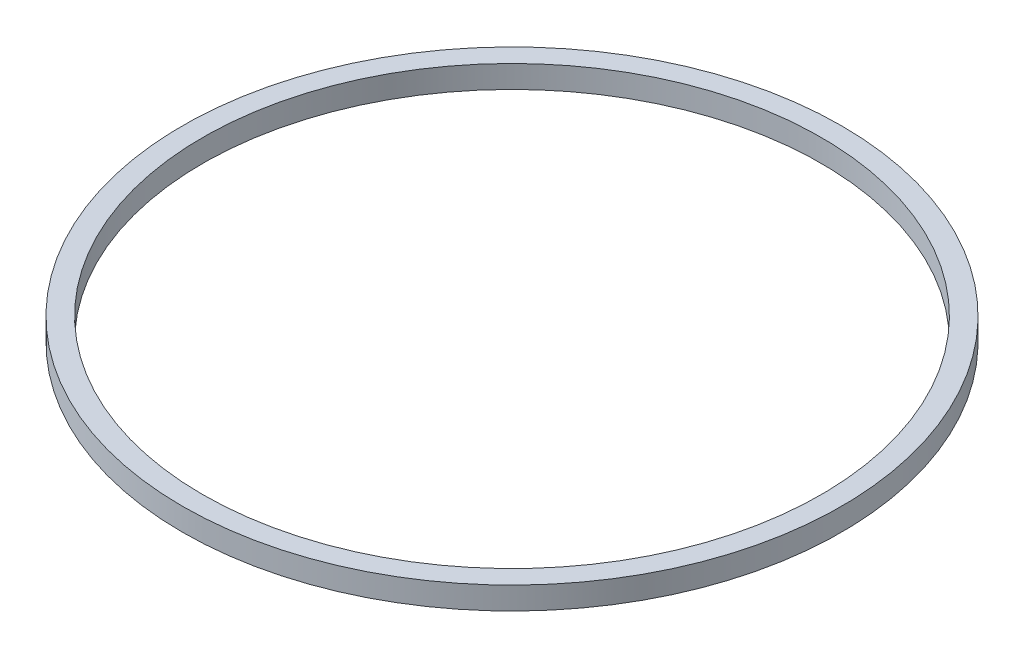
ISO-10303-21;
HEADER;
FILE_DESCRIPTION(('STEP AP214'),'2;1');
FILE_NAME('part.step','',(''),(''),'','','');
FILE_SCHEMA(('AUTOMOTIVE_DESIGN { 1 0 10303 214 1 1 1 1 }'));
ENDSEC;
DATA;
#1=APPLICATION_CONTEXT('core data for automotive mechanical design processes');
#2=APPLICATION_PROTOCOL_DEFINITION('international standard','automotive_design',2000,#1);
#3=PRODUCT_CONTEXT('',#1,'mechanical');
#4=PRODUCT('Part','Part','',(#3));
#5=PRODUCT_RELATED_PRODUCT_CATEGORY('part','',(#4));
#6=PRODUCT_DEFINITION_FORMATION('','',#4);
#7=PRODUCT_DEFINITION_CONTEXT('part definition',#1,'design');
#8=PRODUCT_DEFINITION('design','',#6,#7);
#9=PRODUCT_DEFINITION_SHAPE('','',#8);
#10=(LENGTH_UNIT() NAMED_UNIT(*) SI_UNIT(.MILLI.,.METRE.));
#11=(NAMED_UNIT(*) PLANE_ANGLE_UNIT() SI_UNIT($,.RADIAN.));
#12=(NAMED_UNIT(*) SI_UNIT($,.STERADIAN.) SOLID_ANGLE_UNIT());
#13=UNCERTAINTY_MEASURE_WITH_UNIT(LENGTH_MEASURE(1.E-05),#10,'distance_accuracy_value','');
#14=(GEOMETRIC_REPRESENTATION_CONTEXT(3) GLOBAL_UNCERTAINTY_ASSIGNED_CONTEXT((#13)) GLOBAL_UNIT_ASSIGNED_CONTEXT((#10,
#11,#12)) REPRESENTATION_CONTEXT('',''));
#15=CARTESIAN_POINT('',(0.,0.,0.));
#16=DIRECTION('',(0.,0.,1.));
#17=DIRECTION('',(1.,0.,0.));
#18=AXIS2_PLACEMENT_3D('',#15,#16,#17);
#19=CARTESIAN_POINT('',(0.,2.,0.));
#20=DIRECTION('',(0.,1.,0.));
#21=DIRECTION('',(0.,0.,1.));
#22=AXIS2_PLACEMENT_3D('',#19,#20,#21);
#23=PLANE('',#22);
#24=CARTESIAN_POINT('',(0.,2.,0.));
#25=DIRECTION('',(0.,1.,0.));
#26=DIRECTION('',(0.,0.,1.));
#27=AXIS2_PLACEMENT_3D('',#24,#25,#26);
#28=CIRCLE('',#27,29.3);
#29=CARTESIAN_POINT('',(0.,2.,29.3));
#30=VERTEX_POINT('',#29);
#31=EDGE_CURVE('E10',#30,#30,#28,.T.);
#32=ORIENTED_EDGE('',*,*,#31,.T.);
#33=EDGE_LOOP('',(#32));
#34=FACE_BOUND('',#33,.T.);
#35=CARTESIAN_POINT('',(0.,2.,0.));
#36=DIRECTION('',(0.,1.,0.));
#37=DIRECTION('',(0.,0.,1.));
#38=AXIS2_PLACEMENT_3D('',#35,#36,#37);
#39=CIRCLE('',#38,27.5);
#40=CARTESIAN_POINT('',(0.,2.,27.5));
#41=VERTEX_POINT('',#40);
#42=EDGE_CURVE('E50',#41,#41,#39,.T.);
#43=ORIENTED_EDGE('',*,*,#42,.F.);
#44=EDGE_LOOP('',(#43));
#45=FACE_BOUND('',#44,.T.);
#46=ADVANCED_FACE('F37',(#34,#45),#23,.T.);
#47=CARTESIAN_POINT('',(0.,0.,0.));
#48=DIRECTION('',(0.,1.,0.));
#49=DIRECTION('',(0.,0.,1.));
#50=AXIS2_PLACEMENT_3D('',#47,#48,#49);
#51=PLANE('',#50);
#52=CARTESIAN_POINT('',(0.,0.,0.));
#53=DIRECTION('',(0.,1.,0.));
#54=DIRECTION('',(0.,0.,1.));
#55=AXIS2_PLACEMENT_3D('',#52,#53,#54);
#56=CIRCLE('',#55,29.3);
#57=CARTESIAN_POINT('',(0.,0.,29.3));
#58=VERTEX_POINT('',#57);
#59=EDGE_CURVE('E41',#58,#58,#56,.T.);
#60=ORIENTED_EDGE('',*,*,#59,.F.);
#61=EDGE_LOOP('',(#60));
#62=FACE_BOUND('',#61,.T.);
#63=CARTESIAN_POINT('',(0.,0.,0.));
#64=DIRECTION('',(0.,1.,0.));
#65=DIRECTION('',(0.,0.,1.));
#66=AXIS2_PLACEMENT_3D('',#63,#64,#65);
#67=CIRCLE('',#66,27.5);
#68=CARTESIAN_POINT('',(0.,0.,27.5));
#69=VERTEX_POINT('',#68);
#70=EDGE_CURVE('E52',#69,#69,#67,.T.);
#71=ORIENTED_EDGE('',*,*,#70,.T.);
#72=EDGE_LOOP('',(#71));
#73=FACE_BOUND('',#72,.T.);
#74=ADVANCED_FACE('F64',(#62,#73),#51,.F.);
#75=CARTESIAN_POINT('',(0.,2.,0.));
#76=DIRECTION('',(0.,-1.,0.));
#77=DIRECTION('',(0.,0.,-1.));
#78=AXIS2_PLACEMENT_3D('',#75,#76,#77);
#79=CYLINDRICAL_SURFACE('',#78,29.3);
#80=ORIENTED_EDGE('',*,*,#31,.F.);
#81=EDGE_LOOP('',(#80));
#82=FACE_BOUND('',#81,.T.);
#83=ORIENTED_EDGE('',*,*,#59,.T.);
#84=EDGE_LOOP('',(#83));
#85=FACE_BOUND('',#84,.T.);
#86=ADVANCED_FACE('F39',(#82,#85),#79,.T.);
#87=CARTESIAN_POINT('',(0.,2.,0.));
#88=DIRECTION('',(0.,-1.,0.));
#89=DIRECTION('',(0.,0.,-1.));
#90=AXIS2_PLACEMENT_3D('',#87,#88,#89);
#91=CYLINDRICAL_SURFACE('',#90,27.5);
#92=ORIENTED_EDGE('',*,*,#42,.T.);
#93=EDGE_LOOP('',(#92));
#94=FACE_BOUND('',#93,.T.);
#95=ORIENTED_EDGE('',*,*,#70,.F.);
#96=EDGE_LOOP('',(#95));
#97=FACE_BOUND('',#96,.T.);
#98=ADVANCED_FACE('F60',(#94,#97),#91,.F.);
#99=CLOSED_SHELL('',(#46,#74,#86,#98));
#100=MANIFOLD_SOLID_BREP('B2',#99);
#101=ADVANCED_BREP_SHAPE_REPRESENTATION('',(#18,#100),#14);
#102=SHAPE_DEFINITION_REPRESENTATION(#9,#101);
ENDSEC;
END-ISO-10303-21;
